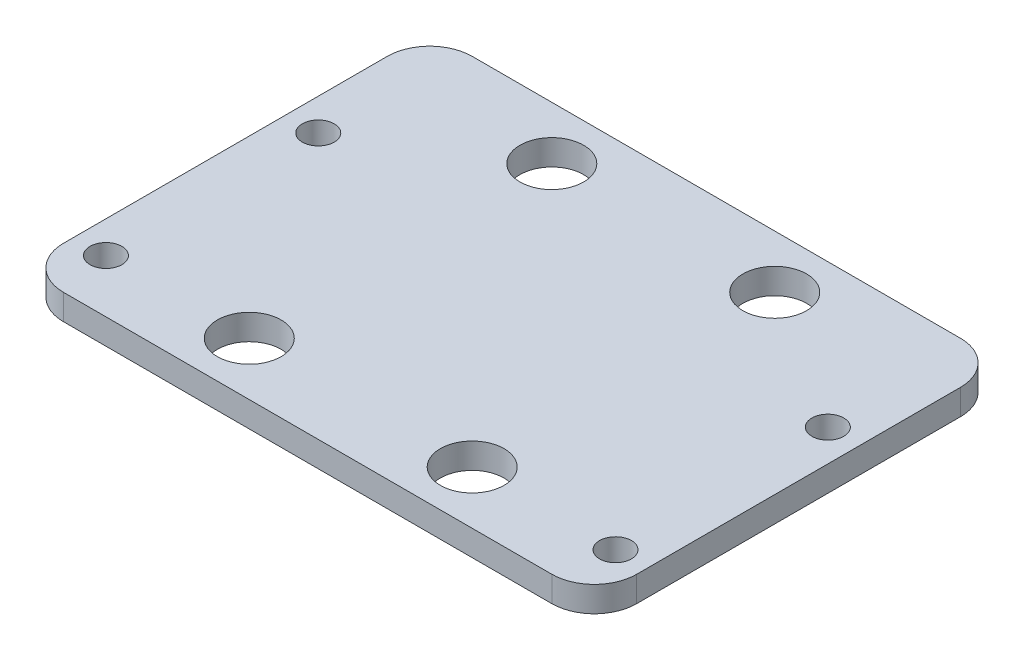
ISO-10303-21;
HEADER;
FILE_DESCRIPTION(('STEP AP214'),'2;1');
FILE_NAME('part.step','',(''),(''),'','','');
FILE_SCHEMA(('AUTOMOTIVE_DESIGN { 1 0 10303 214 1 1 1 1 }'));
ENDSEC;
DATA;
#1=APPLICATION_CONTEXT('core data for automotive mechanical design processes');
#2=APPLICATION_PROTOCOL_DEFINITION('international standard','automotive_design',2000,#1);
#3=PRODUCT_CONTEXT('',#1,'mechanical');
#4=PRODUCT('Part','Part','',(#3));
#5=PRODUCT_RELATED_PRODUCT_CATEGORY('part','',(#4));
#6=PRODUCT_DEFINITION_FORMATION('','',#4);
#7=PRODUCT_DEFINITION_CONTEXT('part definition',#1,'design');
#8=PRODUCT_DEFINITION('design','',#6,#7);
#9=PRODUCT_DEFINITION_SHAPE('','',#8);
#10=(LENGTH_UNIT() NAMED_UNIT(*) SI_UNIT(.MILLI.,.METRE.));
#11=(NAMED_UNIT(*) PLANE_ANGLE_UNIT() SI_UNIT($,.RADIAN.));
#12=(NAMED_UNIT(*) SI_UNIT($,.STERADIAN.) SOLID_ANGLE_UNIT());
#13=UNCERTAINTY_MEASURE_WITH_UNIT(LENGTH_MEASURE(1.E-05),#10,'distance_accuracy_value','');
#14=(GEOMETRIC_REPRESENTATION_CONTEXT(3) GLOBAL_UNCERTAINTY_ASSIGNED_CONTEXT((#13)) GLOBAL_UNIT_ASSIGNED_CONTEXT((#10,
#11,#12)) REPRESENTATION_CONTEXT('',''));
#15=CARTESIAN_POINT('',(0.,0.,0.));
#16=DIRECTION('',(0.,0.,1.));
#17=DIRECTION('',(1.,0.,0.));
#18=AXIS2_PLACEMENT_3D('',#15,#16,#17);
#19=CARTESIAN_POINT('',(0.,2.4,0.));
#20=DIRECTION('',(0.,1.,0.));
#21=DIRECTION('',(0.,0.,1.));
#22=AXIS2_PLACEMENT_3D('',#19,#20,#21);
#23=PLANE('',#22);
#24=CARTESIAN_POINT('',(-24.,2.4,-20.));
#25=DIRECTION('',(0.,1.,0.));
#26=DIRECTION('',(0.,0.,1.));
#27=AXIS2_PLACEMENT_3D('',#24,#25,#26);
#28=CIRCLE('',#27,1.5);
#29=CARTESIAN_POINT('',(-24.,2.4,-18.5));
#30=VERTEX_POINT('',#29);
#31=EDGE_CURVE('E211',#30,#30,#28,.T.);
#32=ORIENTED_EDGE('',*,*,#31,.F.);
#33=EDGE_LOOP('',(#32));
#34=FACE_BOUND('',#33,.T.);
#35=CARTESIAN_POINT('',(-10.5,2.4,0.));
#36=DIRECTION('',(0.,1.,0.));
#37=DIRECTION('',(0.,0.,1.));
#38=AXIS2_PLACEMENT_3D('',#35,#36,#37);
#39=CIRCLE('',#38,3.);
#40=CARTESIAN_POINT('',(-10.5,2.4,3.00000000000002));
#41=VERTEX_POINT('',#40);
#42=EDGE_CURVE('E199',#41,#41,#39,.T.);
#43=ORIENTED_EDGE('',*,*,#42,.F.);
#44=EDGE_LOOP('',(#43));
#45=FACE_BOUND('',#44,.T.);
#46=CARTESIAN_POINT('',(-10.5,2.4,-28.5));
#47=DIRECTION('',(0.,1.,0.));
#48=DIRECTION('',(0.,0.,1.));
#49=AXIS2_PLACEMENT_3D('',#46,#47,#48);
#50=CIRCLE('',#49,3.);
#51=CARTESIAN_POINT('',(-10.5,2.4,-25.5));
#52=VERTEX_POINT('',#51);
#53=EDGE_CURVE('E187',#52,#52,#50,.T.);
#54=ORIENTED_EDGE('',*,*,#53,.F.);
#55=EDGE_LOOP('',(#54));
#56=FACE_BOUND('',#55,.T.);
#57=CARTESIAN_POINT('',(-24.,2.4,0.));
#58=DIRECTION('',(0.,1.,0.));
#59=DIRECTION('',(0.,0.,1.));
#60=AXIS2_PLACEMENT_3D('',#57,#58,#59);
#61=CIRCLE('',#60,1.5);
#62=CARTESIAN_POINT('',(-24.,2.4,1.5));
#63=VERTEX_POINT('',#62);
#64=EDGE_CURVE('E133',#63,#63,#61,.T.);
#65=ORIENTED_EDGE('',*,*,#64,.F.);
#66=EDGE_LOOP('',(#65));
#67=FACE_BOUND('',#66,.T.);
#68=DIRECTION('',(0.,0.,-1.));
#69=VECTOR('',#68,1.);
#70=CARTESIAN_POINT('',(27.,2.4,-33.5));
#71=LINE('',#70,#69);
#72=CARTESIAN_POINT('',(27.,2.4,0.999999999999987));
#73=VERTEX_POINT('',#72);
#74=CARTESIAN_POINT('',(27.,2.4,-29.5));
#75=VERTEX_POINT('',#74);
#76=EDGE_CURVE('E138',#73,#75,#71,.T.);
#77=ORIENTED_EDGE('',*,*,#76,.T.);
#78=CARTESIAN_POINT('',(23.,2.4,-29.5));
#79=DIRECTION('',(0.,1.,0.));
#80=DIRECTION('',(0.,0.,1.));
#81=AXIS2_PLACEMENT_3D('',#78,#79,#80);
#82=CIRCLE('',#81,4.);
#83=CARTESIAN_POINT('',(23.,2.4,-33.5));
#84=VERTEX_POINT('',#83);
#85=EDGE_CURVE('E153',#75,#84,#82,.T.);
#86=ORIENTED_EDGE('',*,*,#85,.T.);
#87=DIRECTION('',(-1.,0.,0.));
#88=VECTOR('',#87,1.);
#89=CARTESIAN_POINT('',(-27.,2.4,-33.5));
#90=LINE('',#89,#88);
#91=CARTESIAN_POINT('',(-23.,2.4,-33.5));
#92=VERTEX_POINT('',#91);
#93=EDGE_CURVE('E120',#84,#92,#90,.T.);
#94=ORIENTED_EDGE('',*,*,#93,.T.);
#95=CARTESIAN_POINT('',(-23.,2.4,-29.5));
#96=DIRECTION('',(0.,1.,0.));
#97=DIRECTION('',(0.,0.,1.));
#98=AXIS2_PLACEMENT_3D('',#95,#96,#97);
#99=CIRCLE('',#98,4.);
#100=CARTESIAN_POINT('',(-27.,2.4,-29.5));
#101=VERTEX_POINT('',#100);
#102=EDGE_CURVE('E151',#92,#101,#99,.T.);
#103=ORIENTED_EDGE('',*,*,#102,.T.);
#104=DIRECTION('',(0.,0.,1.));
#105=VECTOR('',#104,1.);
#106=CARTESIAN_POINT('',(-27.,2.4,-33.5));
#107=LINE('',#106,#105);
#108=CARTESIAN_POINT('',(-27.,2.4,0.999999999999987));
#109=VERTEX_POINT('',#108);
#110=EDGE_CURVE('E164',#101,#109,#107,.T.);
#111=ORIENTED_EDGE('',*,*,#110,.T.);
#112=CARTESIAN_POINT('',(-23.,2.4,1.));
#113=DIRECTION('',(0.,1.,0.));
#114=DIRECTION('',(0.,0.,1.));
#115=AXIS2_PLACEMENT_3D('',#112,#113,#114);
#116=CIRCLE('',#115,4.);
#117=CARTESIAN_POINT('',(-23.,2.4,5.));
#118=VERTEX_POINT('',#117);
#119=EDGE_CURVE('E55',#109,#118,#116,.T.);
#120=ORIENTED_EDGE('',*,*,#119,.T.);
#121=DIRECTION('',(1.,0.,0.));
#122=VECTOR('',#121,1.);
#123=CARTESIAN_POINT('',(-27.,2.4,5.));
#124=LINE('',#123,#122);
#125=CARTESIAN_POINT('',(23.,2.4,5.));
#126=VERTEX_POINT('',#125);
#127=EDGE_CURVE('E139',#118,#126,#124,.T.);
#128=ORIENTED_EDGE('',*,*,#127,.T.);
#129=CARTESIAN_POINT('',(23.,2.4,1.));
#130=DIRECTION('',(0.,1.,0.));
#131=DIRECTION('',(0.,0.,1.));
#132=AXIS2_PLACEMENT_3D('',#129,#130,#131);
#133=CIRCLE('',#132,4.);
#134=EDGE_CURVE('E148',#126,#73,#133,.T.);
#135=ORIENTED_EDGE('',*,*,#134,.T.);
#136=EDGE_LOOP('',(#77,#86,#94,#103,#111,#120,#128,#135));
#137=FACE_BOUND('',#136,.T.);
#138=CARTESIAN_POINT('',(24.,2.4,0.));
#139=DIRECTION('',(0.,1.,0.));
#140=DIRECTION('',(0.,0.,-1.));
#141=AXIS2_PLACEMENT_3D('',#138,#139,#140);
#142=CIRCLE('',#141,1.5);
#143=CARTESIAN_POINT('',(24.,2.4,-1.5));
#144=VERTEX_POINT('',#143);
#145=EDGE_CURVE('E181',#144,#144,#142,.T.);
#146=ORIENTED_EDGE('',*,*,#145,.F.);
#147=EDGE_LOOP('',(#146));
#148=FACE_BOUND('',#147,.T.);
#149=CARTESIAN_POINT('',(10.5,2.4,-28.5));
#150=DIRECTION('',(0.,1.,0.));
#151=DIRECTION('',(0.,0.,-1.));
#152=AXIS2_PLACEMENT_3D('',#149,#150,#151);
#153=CIRCLE('',#152,3.);
#154=CARTESIAN_POINT('',(10.5,2.4,-31.5));
#155=VERTEX_POINT('',#154);
#156=EDGE_CURVE('E193',#155,#155,#153,.T.);
#157=ORIENTED_EDGE('',*,*,#156,.F.);
#158=EDGE_LOOP('',(#157));
#159=FACE_BOUND('',#158,.T.);
#160=CARTESIAN_POINT('',(10.5,2.4,0.));
#161=DIRECTION('',(0.,1.,0.));
#162=DIRECTION('',(0.,0.,-1.));
#163=AXIS2_PLACEMENT_3D('',#160,#161,#162);
#164=CIRCLE('',#163,3.);
#165=CARTESIAN_POINT('',(10.5,2.4,-2.99999999999999));
#166=VERTEX_POINT('',#165);
#167=EDGE_CURVE('E205',#166,#166,#164,.T.);
#168=ORIENTED_EDGE('',*,*,#167,.F.);
#169=EDGE_LOOP('',(#168));
#170=FACE_BOUND('',#169,.T.);
#171=CARTESIAN_POINT('',(24.,2.4,-20.));
#172=DIRECTION('',(0.,1.,0.));
#173=DIRECTION('',(0.,0.,-1.));
#174=AXIS2_PLACEMENT_3D('',#171,#172,#173);
#175=CIRCLE('',#174,1.5);
#176=CARTESIAN_POINT('',(24.,2.4,-21.5));
#177=VERTEX_POINT('',#176);
#178=EDGE_CURVE('E217',#177,#177,#175,.T.);
#179=ORIENTED_EDGE('',*,*,#178,.F.);
#180=EDGE_LOOP('',(#179));
#181=FACE_BOUND('',#180,.T.);
#182=ADVANCED_FACE('F34',(#34,#45,#56,#67,#137,#148,#159,#170,#181),#23,.T.);
#183=CARTESIAN_POINT('',(0.,0.,0.));
#184=DIRECTION('',(0.,1.,0.));
#185=DIRECTION('',(0.,0.,1.));
#186=AXIS2_PLACEMENT_3D('',#183,#184,#185);
#187=PLANE('',#186);
#188=DIRECTION('',(-1.,0.,0.));
#189=VECTOR('',#188,1.);
#190=CARTESIAN_POINT('',(-27.,0.,-33.5));
#191=LINE('',#190,#189);
#192=CARTESIAN_POINT('',(23.,0.,-33.5));
#193=VERTEX_POINT('',#192);
#194=CARTESIAN_POINT('',(-23.,0.,-33.5));
#195=VERTEX_POINT('',#194);
#196=EDGE_CURVE('E117',#193,#195,#191,.T.);
#197=ORIENTED_EDGE('',*,*,#196,.F.);
#198=CARTESIAN_POINT('',(23.,0.,-29.5));
#199=DIRECTION('',(0.,1.,0.));
#200=DIRECTION('',(0.,0.,1.));
#201=AXIS2_PLACEMENT_3D('',#198,#199,#200);
#202=CIRCLE('',#201,4.);
#203=CARTESIAN_POINT('',(27.,0.,-29.5));
#204=VERTEX_POINT('',#203);
#205=EDGE_CURVE('E100',#193,#204,#202,.F.);
#206=ORIENTED_EDGE('',*,*,#205,.T.);
#207=DIRECTION('',(0.,0.,-1.));
#208=VECTOR('',#207,1.);
#209=CARTESIAN_POINT('',(27.,0.,-33.5));
#210=LINE('',#209,#208);
#211=CARTESIAN_POINT('',(27.,0.,0.999999999999987));
#212=VERTEX_POINT('',#211);
#213=EDGE_CURVE('E128',#212,#204,#210,.T.);
#214=ORIENTED_EDGE('',*,*,#213,.F.);
#215=CARTESIAN_POINT('',(23.,0.,1.));
#216=DIRECTION('',(0.,1.,0.));
#217=DIRECTION('',(0.,0.,1.));
#218=AXIS2_PLACEMENT_3D('',#215,#216,#217);
#219=CIRCLE('',#218,4.);
#220=CARTESIAN_POINT('',(23.,0.,5.));
#221=VERTEX_POINT('',#220);
#222=EDGE_CURVE('E121',#212,#221,#219,.F.);
#223=ORIENTED_EDGE('',*,*,#222,.T.);
#224=DIRECTION('',(1.,0.,0.));
#225=VECTOR('',#224,1.);
#226=CARTESIAN_POINT('',(-27.,0.,5.));
#227=LINE('',#226,#225);
#228=CARTESIAN_POINT('',(-23.,0.,5.));
#229=VERTEX_POINT('',#228);
#230=EDGE_CURVE('E131',#229,#221,#227,.T.);
#231=ORIENTED_EDGE('',*,*,#230,.F.);
#232=CARTESIAN_POINT('',(-23.,0.,1.));
#233=DIRECTION('',(0.,1.,0.));
#234=DIRECTION('',(0.,0.,1.));
#235=AXIS2_PLACEMENT_3D('',#232,#233,#234);
#236=CIRCLE('',#235,4.);
#237=CARTESIAN_POINT('',(-27.,0.,0.999999999999987));
#238=VERTEX_POINT('',#237);
#239=EDGE_CURVE('E142',#229,#238,#236,.F.);
#240=ORIENTED_EDGE('',*,*,#239,.T.);
#241=DIRECTION('',(0.,0.,1.));
#242=VECTOR('',#241,1.);
#243=CARTESIAN_POINT('',(-27.,0.,-33.5));
#244=LINE('',#243,#242);
#245=CARTESIAN_POINT('',(-27.,0.,-29.5));
#246=VERTEX_POINT('',#245);
#247=EDGE_CURVE('E127',#246,#238,#244,.T.);
#248=ORIENTED_EDGE('',*,*,#247,.F.);
#249=CARTESIAN_POINT('',(-23.,0.,-29.5));
#250=DIRECTION('',(0.,1.,0.));
#251=DIRECTION('',(0.,0.,1.));
#252=AXIS2_PLACEMENT_3D('',#249,#250,#251);
#253=CIRCLE('',#252,4.);
#254=EDGE_CURVE('E111',#246,#195,#253,.F.);
#255=ORIENTED_EDGE('',*,*,#254,.T.);
#256=EDGE_LOOP('',(#197,#206,#214,#223,#231,#240,#248,#255));
#257=FACE_BOUND('',#256,.T.);
#258=CARTESIAN_POINT('',(-24.,0.,0.));
#259=DIRECTION('',(0.,1.,0.));
#260=DIRECTION('',(0.,0.,1.));
#261=AXIS2_PLACEMENT_3D('',#258,#259,#260);
#262=CIRCLE('',#261,1.5);
#263=CARTESIAN_POINT('',(-24.,0.,1.5));
#264=VERTEX_POINT('',#263);
#265=EDGE_CURVE('E178',#264,#264,#262,.T.);
#266=ORIENTED_EDGE('',*,*,#265,.T.);
#267=EDGE_LOOP('',(#266));
#268=FACE_BOUND('',#267,.T.);
#269=CARTESIAN_POINT('',(24.,0.,0.));
#270=DIRECTION('',(0.,1.,0.));
#271=DIRECTION('',(0.,0.,-1.));
#272=AXIS2_PLACEMENT_3D('',#269,#270,#271);
#273=CIRCLE('',#272,1.5);
#274=CARTESIAN_POINT('',(24.,0.,-1.5));
#275=VERTEX_POINT('',#274);
#276=EDGE_CURVE('E184',#275,#275,#273,.T.);
#277=ORIENTED_EDGE('',*,*,#276,.T.);
#278=EDGE_LOOP('',(#277));
#279=FACE_BOUND('',#278,.T.);
#280=CARTESIAN_POINT('',(-10.5,0.,-28.5));
#281=DIRECTION('',(0.,1.,0.));
#282=DIRECTION('',(0.,0.,1.));
#283=AXIS2_PLACEMENT_3D('',#280,#281,#282);
#284=CIRCLE('',#283,3.);
#285=CARTESIAN_POINT('',(-10.5,0.,-25.5));
#286=VERTEX_POINT('',#285);
#287=EDGE_CURVE('E190',#286,#286,#284,.T.);
#288=ORIENTED_EDGE('',*,*,#287,.T.);
#289=EDGE_LOOP('',(#288));
#290=FACE_BOUND('',#289,.T.);
#291=CARTESIAN_POINT('',(10.5,0.,-28.5));
#292=DIRECTION('',(0.,1.,0.));
#293=DIRECTION('',(0.,0.,-1.));
#294=AXIS2_PLACEMENT_3D('',#291,#292,#293);
#295=CIRCLE('',#294,3.);
#296=CARTESIAN_POINT('',(10.5,0.,-31.5));
#297=VERTEX_POINT('',#296);
#298=EDGE_CURVE('E196',#297,#297,#295,.T.);
#299=ORIENTED_EDGE('',*,*,#298,.T.);
#300=EDGE_LOOP('',(#299));
#301=FACE_BOUND('',#300,.T.);
#302=CARTESIAN_POINT('',(-10.5,0.,0.));
#303=DIRECTION('',(0.,1.,0.));
#304=DIRECTION('',(0.,0.,1.));
#305=AXIS2_PLACEMENT_3D('',#302,#303,#304);
#306=CIRCLE('',#305,3.);
#307=CARTESIAN_POINT('',(-10.5,0.,3.00000000000002));
#308=VERTEX_POINT('',#307);
#309=EDGE_CURVE('E202',#308,#308,#306,.T.);
#310=ORIENTED_EDGE('',*,*,#309,.T.);
#311=EDGE_LOOP('',(#310));
#312=FACE_BOUND('',#311,.T.);
#313=CARTESIAN_POINT('',(10.5,0.,0.));
#314=DIRECTION('',(0.,1.,0.));
#315=DIRECTION('',(0.,0.,-1.));
#316=AXIS2_PLACEMENT_3D('',#313,#314,#315);
#317=CIRCLE('',#316,3.);
#318=CARTESIAN_POINT('',(10.5,0.,-2.99999999999999));
#319=VERTEX_POINT('',#318);
#320=EDGE_CURVE('E208',#319,#319,#317,.T.);
#321=ORIENTED_EDGE('',*,*,#320,.T.);
#322=EDGE_LOOP('',(#321));
#323=FACE_BOUND('',#322,.T.);
#324=CARTESIAN_POINT('',(-24.,0.,-20.));
#325=DIRECTION('',(0.,1.,0.));
#326=DIRECTION('',(0.,0.,1.));
#327=AXIS2_PLACEMENT_3D('',#324,#325,#326);
#328=CIRCLE('',#327,1.5);
#329=CARTESIAN_POINT('',(-24.,0.,-18.5));
#330=VERTEX_POINT('',#329);
#331=EDGE_CURVE('E214',#330,#330,#328,.T.);
#332=ORIENTED_EDGE('',*,*,#331,.T.);
#333=EDGE_LOOP('',(#332));
#334=FACE_BOUND('',#333,.T.);
#335=CARTESIAN_POINT('',(24.,0.,-20.));
#336=DIRECTION('',(0.,1.,0.));
#337=DIRECTION('',(0.,0.,-1.));
#338=AXIS2_PLACEMENT_3D('',#335,#336,#337);
#339=CIRCLE('',#338,1.5);
#340=CARTESIAN_POINT('',(24.,0.,-21.5));
#341=VERTEX_POINT('',#340);
#342=EDGE_CURVE('E220',#341,#341,#339,.T.);
#343=ORIENTED_EDGE('',*,*,#342,.T.);
#344=EDGE_LOOP('',(#343));
#345=FACE_BOUND('',#344,.T.);
#346=ADVANCED_FACE('F124',(#257,#268,#279,#290,#301,#312,#323,#334,#345),#187,.F.);
#347=CARTESIAN_POINT('',(27.,2.4,-33.5));
#348=DIRECTION('',(-1.,0.,0.));
#349=DIRECTION('',(0.,0.,1.));
#350=AXIS2_PLACEMENT_3D('',#347,#348,#349);
#351=PLANE('',#350);
#352=ORIENTED_EDGE('',*,*,#213,.T.);
#353=DIRECTION('',(0.,-1.,0.));
#354=VECTOR('',#353,1.);
#355=CARTESIAN_POINT('',(27.,2.4,-29.5));
#356=LINE('',#355,#354);
#357=EDGE_CURVE('E105',#204,#75,#356,.F.);
#358=ORIENTED_EDGE('',*,*,#357,.T.);
#359=ORIENTED_EDGE('',*,*,#76,.F.);
#360=DIRECTION('',(0.,-1.,0.));
#361=VECTOR('',#360,1.);
#362=CARTESIAN_POINT('',(27.,2.4,1.));
#363=LINE('',#362,#361);
#364=EDGE_CURVE('E110',#73,#212,#363,.T.);
#365=ORIENTED_EDGE('',*,*,#364,.T.);
#366=EDGE_LOOP('',(#352,#358,#359,#365));
#367=FACE_BOUND('',#366,.T.);
#368=ADVANCED_FACE('F235',(#367),#351,.F.);
#369=CARTESIAN_POINT('',(-27.,2.4,-33.5));
#370=DIRECTION('',(0.,0.,1.));
#371=DIRECTION('',(1.,0.,0.));
#372=AXIS2_PLACEMENT_3D('',#369,#370,#371);
#373=PLANE('',#372);
#374=ORIENTED_EDGE('',*,*,#93,.F.);
#375=DIRECTION('',(0.,-1.,0.));
#376=VECTOR('',#375,1.);
#377=CARTESIAN_POINT('',(23.,2.4,-33.5));
#378=LINE('',#377,#376);
#379=EDGE_CURVE('E104',#84,#193,#378,.T.);
#380=ORIENTED_EDGE('',*,*,#379,.T.);
#381=ORIENTED_EDGE('',*,*,#196,.T.);
#382=DIRECTION('',(0.,-1.,0.));
#383=VECTOR('',#382,1.);
#384=CARTESIAN_POINT('',(-23.,2.4,-33.5));
#385=LINE('',#384,#383);
#386=EDGE_CURVE('E122',#195,#92,#385,.F.);
#387=ORIENTED_EDGE('',*,*,#386,.T.);
#388=EDGE_LOOP('',(#374,#380,#381,#387));
#389=FACE_BOUND('',#388,.T.);
#390=ADVANCED_FACE('F116',(#389),#373,.F.);
#391=CARTESIAN_POINT('',(-27.,2.4,-33.5));
#392=DIRECTION('',(1.,0.,0.));
#393=DIRECTION('',(0.,0.,-1.));
#394=AXIS2_PLACEMENT_3D('',#391,#392,#393);
#395=PLANE('',#394);
#396=ORIENTED_EDGE('',*,*,#110,.F.);
#397=DIRECTION('',(0.,-1.,0.));
#398=VECTOR('',#397,1.);
#399=CARTESIAN_POINT('',(-27.,2.4,-29.5));
#400=LINE('',#399,#398);
#401=EDGE_CURVE('E157',#101,#246,#400,.T.);
#402=ORIENTED_EDGE('',*,*,#401,.T.);
#403=ORIENTED_EDGE('',*,*,#247,.T.);
#404=DIRECTION('',(0.,-1.,0.));
#405=VECTOR('',#404,1.);
#406=CARTESIAN_POINT('',(-27.,2.4,1.));
#407=LINE('',#406,#405);
#408=EDGE_CURVE('E155',#238,#109,#407,.F.);
#409=ORIENTED_EDGE('',*,*,#408,.T.);
#410=EDGE_LOOP('',(#396,#402,#403,#409));
#411=FACE_BOUND('',#410,.T.);
#412=ADVANCED_FACE('F162',(#411),#395,.F.);
#413=CARTESIAN_POINT('',(-27.,2.4,5.));
#414=DIRECTION('',(0.,0.,-1.));
#415=DIRECTION('',(-1.,0.,0.));
#416=AXIS2_PLACEMENT_3D('',#413,#414,#415);
#417=PLANE('',#416);
#418=ORIENTED_EDGE('',*,*,#127,.F.);
#419=DIRECTION('',(0.,-1.,0.));
#420=VECTOR('',#419,1.);
#421=CARTESIAN_POINT('',(-23.,2.4,5.));
#422=LINE('',#421,#420);
#423=EDGE_CURVE('E11',#118,#229,#422,.T.);
#424=ORIENTED_EDGE('',*,*,#423,.T.);
#425=ORIENTED_EDGE('',*,*,#230,.T.);
#426=DIRECTION('',(0.,-1.,0.));
#427=VECTOR('',#426,1.);
#428=CARTESIAN_POINT('',(23.,2.4,5.));
#429=LINE('',#428,#427);
#430=EDGE_CURVE('E42',#221,#126,#429,.F.);
#431=ORIENTED_EDGE('',*,*,#430,.T.);
#432=EDGE_LOOP('',(#418,#424,#425,#431));
#433=FACE_BOUND('',#432,.T.);
#434=ADVANCED_FACE('F171',(#433),#417,.F.);
#435=CARTESIAN_POINT('',(-24.,2.4,0.));
#436=DIRECTION('',(0.,-1.,0.));
#437=DIRECTION('',(0.,0.,-1.));
#438=AXIS2_PLACEMENT_3D('',#435,#436,#437);
#439=CYLINDRICAL_SURFACE('',#438,1.5);
#440=ORIENTED_EDGE('',*,*,#64,.T.);
#441=EDGE_LOOP('',(#440));
#442=FACE_BOUND('',#441,.T.);
#443=ORIENTED_EDGE('',*,*,#265,.F.);
#444=EDGE_LOOP('',(#443));
#445=FACE_BOUND('',#444,.T.);
#446=ADVANCED_FACE('F240',(#442,#445),#439,.F.);
#447=CARTESIAN_POINT('',(24.,2.4,0.));
#448=DIRECTION('',(0.,-1.,0.));
#449=DIRECTION('',(0.,0.,-1.));
#450=AXIS2_PLACEMENT_3D('',#447,#448,#449);
#451=CYLINDRICAL_SURFACE('',#450,1.5);
#452=ORIENTED_EDGE('',*,*,#145,.T.);
#453=EDGE_LOOP('',(#452));
#454=FACE_BOUND('',#453,.T.);
#455=ORIENTED_EDGE('',*,*,#276,.F.);
#456=EDGE_LOOP('',(#455));
#457=FACE_BOUND('',#456,.T.);
#458=ADVANCED_FACE('F301',(#454,#457),#451,.F.);
#459=CARTESIAN_POINT('',(-10.5,2.4,-28.5));
#460=DIRECTION('',(0.,-1.,0.));
#461=DIRECTION('',(0.,0.,-1.));
#462=AXIS2_PLACEMENT_3D('',#459,#460,#461);
#463=CYLINDRICAL_SURFACE('',#462,3.);
#464=ORIENTED_EDGE('',*,*,#53,.T.);
#465=EDGE_LOOP('',(#464));
#466=FACE_BOUND('',#465,.T.);
#467=ORIENTED_EDGE('',*,*,#287,.F.);
#468=EDGE_LOOP('',(#467));
#469=FACE_BOUND('',#468,.T.);
#470=ADVANCED_FACE('F298',(#466,#469),#463,.F.);
#471=CARTESIAN_POINT('',(10.5,2.4,-28.5));
#472=DIRECTION('',(0.,-1.,0.));
#473=DIRECTION('',(0.,0.,-1.));
#474=AXIS2_PLACEMENT_3D('',#471,#472,#473);
#475=CYLINDRICAL_SURFACE('',#474,3.);
#476=ORIENTED_EDGE('',*,*,#156,.T.);
#477=EDGE_LOOP('',(#476));
#478=FACE_BOUND('',#477,.T.);
#479=ORIENTED_EDGE('',*,*,#298,.F.);
#480=EDGE_LOOP('',(#479));
#481=FACE_BOUND('',#480,.T.);
#482=ADVANCED_FACE('F294',(#478,#481),#475,.F.);
#483=CARTESIAN_POINT('',(-10.5,2.4,0.));
#484=DIRECTION('',(0.,-1.,0.));
#485=DIRECTION('',(0.,0.,-1.));
#486=AXIS2_PLACEMENT_3D('',#483,#484,#485);
#487=CYLINDRICAL_SURFACE('',#486,3.);
#488=ORIENTED_EDGE('',*,*,#42,.T.);
#489=EDGE_LOOP('',(#488));
#490=FACE_BOUND('',#489,.T.);
#491=ORIENTED_EDGE('',*,*,#309,.F.);
#492=EDGE_LOOP('',(#491));
#493=FACE_BOUND('',#492,.T.);
#494=ADVANCED_FACE('F276',(#490,#493),#487,.F.);
#495=CARTESIAN_POINT('',(10.5,2.4,0.));
#496=DIRECTION('',(0.,-1.,0.));
#497=DIRECTION('',(0.,0.,-1.));
#498=AXIS2_PLACEMENT_3D('',#495,#496,#497);
#499=CYLINDRICAL_SURFACE('',#498,3.);
#500=ORIENTED_EDGE('',*,*,#167,.T.);
#501=EDGE_LOOP('',(#500));
#502=FACE_BOUND('',#501,.T.);
#503=ORIENTED_EDGE('',*,*,#320,.F.);
#504=EDGE_LOOP('',(#503));
#505=FACE_BOUND('',#504,.T.);
#506=ADVANCED_FACE('F272',(#502,#505),#499,.F.);
#507=CARTESIAN_POINT('',(-24.,2.4,-20.));
#508=DIRECTION('',(0.,-1.,0.));
#509=DIRECTION('',(0.,0.,-1.));
#510=AXIS2_PLACEMENT_3D('',#507,#508,#509);
#511=CYLINDRICAL_SURFACE('',#510,1.5);
#512=ORIENTED_EDGE('',*,*,#31,.T.);
#513=EDGE_LOOP('',(#512));
#514=FACE_BOUND('',#513,.T.);
#515=ORIENTED_EDGE('',*,*,#331,.F.);
#516=EDGE_LOOP('',(#515));
#517=FACE_BOUND('',#516,.T.);
#518=ADVANCED_FACE('F275',(#514,#517),#511,.F.);
#519=CARTESIAN_POINT('',(24.,2.4,-20.));
#520=DIRECTION('',(0.,-1.,0.));
#521=DIRECTION('',(0.,0.,-1.));
#522=AXIS2_PLACEMENT_3D('',#519,#520,#521);
#523=CYLINDRICAL_SURFACE('',#522,1.5);
#524=ORIENTED_EDGE('',*,*,#178,.T.);
#525=EDGE_LOOP('',(#524));
#526=FACE_BOUND('',#525,.T.);
#527=ORIENTED_EDGE('',*,*,#342,.F.);
#528=EDGE_LOOP('',(#527));
#529=FACE_BOUND('',#528,.T.);
#530=ADVANCED_FACE('F226',(#526,#529),#523,.F.);
#531=CARTESIAN_POINT('',(23.,2.4,-29.5));
#532=DIRECTION('',(0.,-1.,0.));
#533=DIRECTION('',(0.,0.,-1.));
#534=AXIS2_PLACEMENT_3D('',#531,#532,#533);
#535=CYLINDRICAL_SURFACE('',#534,4.);
#536=ORIENTED_EDGE('',*,*,#85,.F.);
#537=ORIENTED_EDGE('',*,*,#357,.F.);
#538=ORIENTED_EDGE('',*,*,#205,.F.);
#539=ORIENTED_EDGE('',*,*,#379,.F.);
#540=EDGE_LOOP('',(#536,#537,#538,#539));
#541=FACE_BOUND('',#540,.T.);
#542=ADVANCED_FACE('F103',(#541),#535,.T.);
#543=CARTESIAN_POINT('',(-23.,2.4,-29.5));
#544=DIRECTION('',(0.,-1.,0.));
#545=DIRECTION('',(0.,0.,-1.));
#546=AXIS2_PLACEMENT_3D('',#543,#544,#545);
#547=CYLINDRICAL_SURFACE('',#546,4.);
#548=ORIENTED_EDGE('',*,*,#102,.F.);
#549=ORIENTED_EDGE('',*,*,#386,.F.);
#550=ORIENTED_EDGE('',*,*,#254,.F.);
#551=ORIENTED_EDGE('',*,*,#401,.F.);
#552=EDGE_LOOP('',(#548,#549,#550,#551));
#553=FACE_BOUND('',#552,.T.);
#554=ADVANCED_FACE('F254',(#553),#547,.T.);
#555=CARTESIAN_POINT('',(-23.,2.4,1.));
#556=DIRECTION('',(0.,-1.,0.));
#557=DIRECTION('',(0.,0.,-1.));
#558=AXIS2_PLACEMENT_3D('',#555,#556,#557);
#559=CYLINDRICAL_SURFACE('',#558,4.);
#560=ORIENTED_EDGE('',*,*,#119,.F.);
#561=ORIENTED_EDGE('',*,*,#408,.F.);
#562=ORIENTED_EDGE('',*,*,#239,.F.);
#563=ORIENTED_EDGE('',*,*,#423,.F.);
#564=EDGE_LOOP('',(#560,#561,#562,#563));
#565=FACE_BOUND('',#564,.T.);
#566=ADVANCED_FACE('F170',(#565),#559,.T.);
#567=CARTESIAN_POINT('',(23.,2.4,1.));
#568=DIRECTION('',(0.,-1.,0.));
#569=DIRECTION('',(0.,0.,-1.));
#570=AXIS2_PLACEMENT_3D('',#567,#568,#569);
#571=CYLINDRICAL_SURFACE('',#570,4.);
#572=ORIENTED_EDGE('',*,*,#134,.F.);
#573=ORIENTED_EDGE('',*,*,#430,.F.);
#574=ORIENTED_EDGE('',*,*,#222,.F.);
#575=ORIENTED_EDGE('',*,*,#364,.F.);
#576=EDGE_LOOP('',(#572,#573,#574,#575));
#577=FACE_BOUND('',#576,.T.);
#578=ADVANCED_FACE('F36',(#577),#571,.T.);
#579=CLOSED_SHELL('',(#182,#346,#368,#390,#412,#434,#446,#458,#470,#482,#494,#506,#518,#530,
#542,#554,#566,#578));
#580=MANIFOLD_SOLID_BREP('B2',#579);
#581=ADVANCED_BREP_SHAPE_REPRESENTATION('',(#18,#580),#14);
#582=SHAPE_DEFINITION_REPRESENTATION(#9,#581);
ENDSEC;
END-ISO-10303-21;
